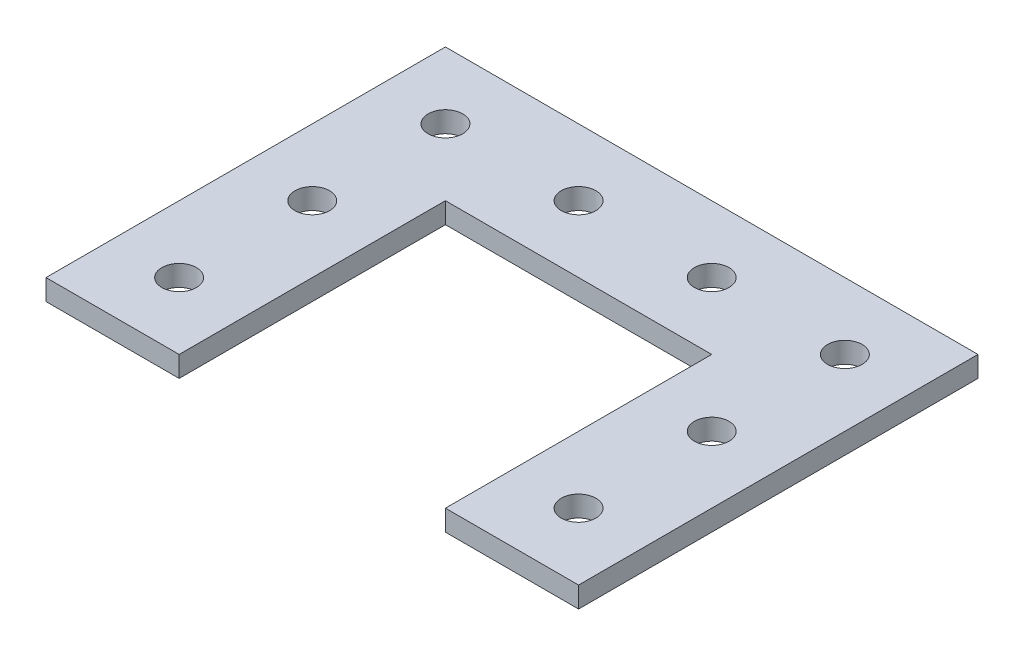
ISO-10303-21;
HEADER;
FILE_DESCRIPTION(('STEP AP214'),'2;1');
FILE_NAME('part.step','',(''),(''),'','','');
FILE_SCHEMA(('AUTOMOTIVE_DESIGN { 1 0 10303 214 1 1 1 1 }'));
ENDSEC;
DATA;
#1=APPLICATION_CONTEXT('core data for automotive mechanical design processes');
#2=APPLICATION_PROTOCOL_DEFINITION('international standard','automotive_design',2000,#1);
#3=PRODUCT_CONTEXT('',#1,'mechanical');
#4=PRODUCT('Part','Part','',(#3));
#5=PRODUCT_RELATED_PRODUCT_CATEGORY('part','',(#4));
#6=PRODUCT_DEFINITION_FORMATION('','',#4);
#7=PRODUCT_DEFINITION_CONTEXT('part definition',#1,'design');
#8=PRODUCT_DEFINITION('design','',#6,#7);
#9=PRODUCT_DEFINITION_SHAPE('','',#8);
#10=(LENGTH_UNIT() NAMED_UNIT(*) SI_UNIT(.MILLI.,.METRE.));
#11=(NAMED_UNIT(*) PLANE_ANGLE_UNIT() SI_UNIT($,.RADIAN.));
#12=(NAMED_UNIT(*) SI_UNIT($,.STERADIAN.) SOLID_ANGLE_UNIT());
#13=UNCERTAINTY_MEASURE_WITH_UNIT(LENGTH_MEASURE(1.E-05),#10,'distance_accuracy_value','');
#14=(GEOMETRIC_REPRESENTATION_CONTEXT(3) GLOBAL_UNCERTAINTY_ASSIGNED_CONTEXT((#13)) GLOBAL_UNIT_ASSIGNED_CONTEXT((#10,
#11,#12)) REPRESENTATION_CONTEXT('',''));
#15=CARTESIAN_POINT('',(0.,0.,0.));
#16=DIRECTION('',(0.,0.,1.));
#17=DIRECTION('',(1.,0.,0.));
#18=AXIS2_PLACEMENT_3D('',#15,#16,#17);
#19=CARTESIAN_POINT('',(0.,3.125,0.));
#20=DIRECTION('',(0.,-1.,0.));
#21=DIRECTION('',(0.,0.,-1.));
#22=AXIS2_PLACEMENT_3D('',#19,#20,#21);
#23=PLANE('',#22);
#24=CARTESIAN_POINT('',(70.,3.125,-30.));
#25=DIRECTION('',(0.,1.,0.));
#26=DIRECTION('',(0.,0.,1.));
#27=AXIS2_PLACEMENT_3D('',#24,#25,#26);
#28=CIRCLE('',#27,2.6);
#29=CARTESIAN_POINT('',(70.,3.125,-27.4));
#30=VERTEX_POINT('',#29);
#31=EDGE_CURVE('E211',#30,#30,#28,.T.);
#32=ORIENTED_EDGE('',*,*,#31,.F.);
#33=EDGE_LOOP('',(#32));
#34=FACE_BOUND('',#33,.T.);
#35=CARTESIAN_POINT('',(50.,3.125,-50.));
#36=DIRECTION('',(0.,1.,0.));
#37=DIRECTION('',(0.,0.,1.));
#38=AXIS2_PLACEMENT_3D('',#35,#36,#37);
#39=CIRCLE('',#38,2.6);
#40=CARTESIAN_POINT('',(50.,3.125,-47.4));
#41=VERTEX_POINT('',#40);
#42=EDGE_CURVE('E199',#41,#41,#39,.T.);
#43=ORIENTED_EDGE('',*,*,#42,.F.);
#44=EDGE_LOOP('',(#43));
#45=FACE_BOUND('',#44,.T.);
#46=CARTESIAN_POINT('',(10.,3.125,-9.99999999999999));
#47=DIRECTION('',(0.,1.,0.));
#48=DIRECTION('',(0.,0.,1.));
#49=AXIS2_PLACEMENT_3D('',#46,#47,#48);
#50=CIRCLE('',#49,2.6);
#51=CARTESIAN_POINT('',(10.,3.125,-7.4));
#52=VERTEX_POINT('',#51);
#53=EDGE_CURVE('E187',#52,#52,#50,.T.);
#54=ORIENTED_EDGE('',*,*,#53,.F.);
#55=EDGE_LOOP('',(#54));
#56=FACE_BOUND('',#55,.T.);
#57=CARTESIAN_POINT('',(10.,3.125,-50.));
#58=DIRECTION('',(0.,1.,0.));
#59=DIRECTION('',(0.,0.,1.));
#60=AXIS2_PLACEMENT_3D('',#57,#58,#59);
#61=CIRCLE('',#60,2.6);
#62=CARTESIAN_POINT('',(10.,3.125,-47.4));
#63=VERTEX_POINT('',#62);
#64=EDGE_CURVE('E133',#63,#63,#61,.T.);
#65=ORIENTED_EDGE('',*,*,#64,.F.);
#66=EDGE_LOOP('',(#65));
#67=FACE_BOUND('',#66,.T.);
#68=DIRECTION('',(1.,0.,0.));
#69=VECTOR('',#68,1.);
#70=CARTESIAN_POINT('',(20.,3.125,0.));
#71=LINE('',#70,#69);
#72=CARTESIAN_POINT('',(0.,3.125,0.));
#73=VERTEX_POINT('',#72);
#74=CARTESIAN_POINT('',(20.,3.125,0.));
#75=VERTEX_POINT('',#74);
#76=EDGE_CURVE('E144',#73,#75,#71,.T.);
#77=ORIENTED_EDGE('',*,*,#76,.T.);
#78=DIRECTION('',(0.,0.,-1.));
#79=VECTOR('',#78,1.);
#80=CARTESIAN_POINT('',(20.,3.125,-40.));
#81=LINE('',#80,#79);
#82=CARTESIAN_POINT('',(20.,3.125,-40.));
#83=VERTEX_POINT('',#82);
#84=EDGE_CURVE('E92',#75,#83,#81,.T.);
#85=ORIENTED_EDGE('',*,*,#84,.T.);
#86=DIRECTION('',(1.,0.,0.));
#87=VECTOR('',#86,1.);
#88=CARTESIAN_POINT('',(60.,3.125,-40.));
#89=LINE('',#88,#87);
#90=CARTESIAN_POINT('',(60.,3.125,-40.));
#91=VERTEX_POINT('',#90);
#92=EDGE_CURVE('E159',#83,#91,#89,.T.);
#93=ORIENTED_EDGE('',*,*,#92,.T.);
#94=DIRECTION('',(0.,0.,1.));
#95=VECTOR('',#94,1.);
#96=CARTESIAN_POINT('',(60.,3.125,0.));
#97=LINE('',#96,#95);
#98=CARTESIAN_POINT('',(60.,3.125,0.));
#99=VERTEX_POINT('',#98);
#100=EDGE_CURVE('E172',#91,#99,#97,.T.);
#101=ORIENTED_EDGE('',*,*,#100,.T.);
#102=DIRECTION('',(1.,0.,0.));
#103=VECTOR('',#102,1.);
#104=CARTESIAN_POINT('',(80.,3.125,0.));
#105=LINE('',#104,#103);
#106=CARTESIAN_POINT('',(80.,3.125,0.));
#107=VERTEX_POINT('',#106);
#108=EDGE_CURVE('E111',#99,#107,#105,.T.);
#109=ORIENTED_EDGE('',*,*,#108,.T.);
#110=DIRECTION('',(0.,0.,-1.));
#111=VECTOR('',#110,1.);
#112=CARTESIAN_POINT('',(80.,3.125,-60.));
#113=LINE('',#112,#111);
#114=CARTESIAN_POINT('',(80.,3.125,-60.));
#115=VERTEX_POINT('',#114);
#116=EDGE_CURVE('E105',#107,#115,#113,.T.);
#117=ORIENTED_EDGE('',*,*,#116,.T.);
#118=DIRECTION('',(-1.,0.,0.));
#119=VECTOR('',#118,1.);
#120=CARTESIAN_POINT('',(0.,3.125,-60.));
#121=LINE('',#120,#119);
#122=CARTESIAN_POINT('',(0.,3.125,-60.));
#123=VERTEX_POINT('',#122);
#124=EDGE_CURVE('E109',#115,#123,#121,.T.);
#125=ORIENTED_EDGE('',*,*,#124,.T.);
#126=DIRECTION('',(0.,0.,1.));
#127=VECTOR('',#126,1.);
#128=CARTESIAN_POINT('',(0.,3.125,0.));
#129=LINE('',#128,#127);
#130=EDGE_CURVE('E49',#123,#73,#129,.T.);
#131=ORIENTED_EDGE('',*,*,#130,.T.);
#132=EDGE_LOOP('',(#77,#85,#93,#101,#109,#117,#125,#131));
#133=FACE_BOUND('',#132,.T.);
#134=CARTESIAN_POINT('',(10.,3.125,-30.));
#135=DIRECTION('',(0.,1.,0.));
#136=DIRECTION('',(0.,0.,1.));
#137=AXIS2_PLACEMENT_3D('',#134,#135,#136);
#138=CIRCLE('',#137,2.6);
#139=CARTESIAN_POINT('',(10.,3.125,-27.4));
#140=VERTEX_POINT('',#139);
#141=EDGE_CURVE('E181',#140,#140,#138,.T.);
#142=ORIENTED_EDGE('',*,*,#141,.F.);
#143=EDGE_LOOP('',(#142));
#144=FACE_BOUND('',#143,.T.);
#145=CARTESIAN_POINT('',(30.,3.125,-50.));
#146=DIRECTION('',(0.,1.,0.));
#147=DIRECTION('',(0.,0.,1.));
#148=AXIS2_PLACEMENT_3D('',#145,#146,#147);
#149=CIRCLE('',#148,2.6);
#150=CARTESIAN_POINT('',(30.,3.125,-47.4));
#151=VERTEX_POINT('',#150);
#152=EDGE_CURVE('E193',#151,#151,#149,.T.);
#153=ORIENTED_EDGE('',*,*,#152,.F.);
#154=EDGE_LOOP('',(#153));
#155=FACE_BOUND('',#154,.T.);
#156=CARTESIAN_POINT('',(70.,3.125,-50.));
#157=DIRECTION('',(0.,1.,0.));
#158=DIRECTION('',(0.,0.,1.));
#159=AXIS2_PLACEMENT_3D('',#156,#157,#158);
#160=CIRCLE('',#159,2.6);
#161=CARTESIAN_POINT('',(70.,3.125,-47.4));
#162=VERTEX_POINT('',#161);
#163=EDGE_CURVE('E205',#162,#162,#160,.T.);
#164=ORIENTED_EDGE('',*,*,#163,.F.);
#165=EDGE_LOOP('',(#164));
#166=FACE_BOUND('',#165,.T.);
#167=CARTESIAN_POINT('',(70.,3.125,-9.99999999999999));
#168=DIRECTION('',(0.,1.,0.));
#169=DIRECTION('',(0.,0.,1.));
#170=AXIS2_PLACEMENT_3D('',#167,#168,#169);
#171=CIRCLE('',#170,2.6);
#172=CARTESIAN_POINT('',(70.,3.125,-7.39999999999999));
#173=VERTEX_POINT('',#172);
#174=EDGE_CURVE('E217',#173,#173,#171,.T.);
#175=ORIENTED_EDGE('',*,*,#174,.F.);
#176=EDGE_LOOP('',(#175));
#177=FACE_BOUND('',#176,.T.);
#178=ADVANCED_FACE('F32',(#34,#45,#56,#67,#133,#144,#155,#166,#177),#23,.F.);
#179=CARTESIAN_POINT('',(0.,0.,0.));
#180=DIRECTION('',(0.,-1.,0.));
#181=DIRECTION('',(0.,0.,-1.));
#182=AXIS2_PLACEMENT_3D('',#179,#180,#181);
#183=PLANE('',#182);
#184=CARTESIAN_POINT('',(70.,0.,-30.));
#185=DIRECTION('',(0.,1.,0.));
#186=DIRECTION('',(0.,0.,1.));
#187=AXIS2_PLACEMENT_3D('',#184,#185,#186);
#188=CIRCLE('',#187,2.6);
#189=CARTESIAN_POINT('',(70.,0.,-27.4));
#190=VERTEX_POINT('',#189);
#191=EDGE_CURVE('E214',#190,#190,#188,.T.);
#192=ORIENTED_EDGE('',*,*,#191,.T.);
#193=EDGE_LOOP('',(#192));
#194=FACE_BOUND('',#193,.T.);
#195=CARTESIAN_POINT('',(50.,0.,-50.));
#196=DIRECTION('',(0.,1.,0.));
#197=DIRECTION('',(0.,0.,1.));
#198=AXIS2_PLACEMENT_3D('',#195,#196,#197);
#199=CIRCLE('',#198,2.6);
#200=CARTESIAN_POINT('',(50.,0.,-47.4));
#201=VERTEX_POINT('',#200);
#202=EDGE_CURVE('E202',#201,#201,#199,.T.);
#203=ORIENTED_EDGE('',*,*,#202,.T.);
#204=EDGE_LOOP('',(#203));
#205=FACE_BOUND('',#204,.T.);
#206=CARTESIAN_POINT('',(10.,0.,-9.99999999999999));
#207=DIRECTION('',(0.,1.,0.));
#208=DIRECTION('',(0.,0.,1.));
#209=AXIS2_PLACEMENT_3D('',#206,#207,#208);
#210=CIRCLE('',#209,2.6);
#211=CARTESIAN_POINT('',(10.,0.,-7.4));
#212=VERTEX_POINT('',#211);
#213=EDGE_CURVE('E190',#212,#212,#210,.T.);
#214=ORIENTED_EDGE('',*,*,#213,.T.);
#215=EDGE_LOOP('',(#214));
#216=FACE_BOUND('',#215,.T.);
#217=CARTESIAN_POINT('',(10.,0.,-50.));
#218=DIRECTION('',(0.,1.,0.));
#219=DIRECTION('',(0.,0.,1.));
#220=AXIS2_PLACEMENT_3D('',#217,#218,#219);
#221=CIRCLE('',#220,2.6);
#222=CARTESIAN_POINT('',(10.,0.,-47.4));
#223=VERTEX_POINT('',#222);
#224=EDGE_CURVE('E178',#223,#223,#221,.T.);
#225=ORIENTED_EDGE('',*,*,#224,.T.);
#226=EDGE_LOOP('',(#225));
#227=FACE_BOUND('',#226,.T.);
#228=DIRECTION('',(1.,0.,0.));
#229=VECTOR('',#228,1.);
#230=CARTESIAN_POINT('',(20.,0.,0.));
#231=LINE('',#230,#229);
#232=CARTESIAN_POINT('',(0.,0.,0.));
#233=VERTEX_POINT('',#232);
#234=CARTESIAN_POINT('',(20.,0.,0.));
#235=VERTEX_POINT('',#234);
#236=EDGE_CURVE('E129',#233,#235,#231,.T.);
#237=ORIENTED_EDGE('',*,*,#236,.F.);
#238=DIRECTION('',(0.,0.,1.));
#239=VECTOR('',#238,1.);
#240=CARTESIAN_POINT('',(0.,0.,0.));
#241=LINE('',#240,#239);
#242=CARTESIAN_POINT('',(0.,0.,-60.));
#243=VERTEX_POINT('',#242);
#244=EDGE_CURVE('E84',#243,#233,#241,.T.);
#245=ORIENTED_EDGE('',*,*,#244,.F.);
#246=DIRECTION('',(-1.,0.,0.));
#247=VECTOR('',#246,1.);
#248=CARTESIAN_POINT('',(0.,0.,-60.));
#249=LINE('',#248,#247);
#250=CARTESIAN_POINT('',(80.,0.,-60.));
#251=VERTEX_POINT('',#250);
#252=EDGE_CURVE('E78',#251,#243,#249,.T.);
#253=ORIENTED_EDGE('',*,*,#252,.F.);
#254=DIRECTION('',(0.,0.,-1.));
#255=VECTOR('',#254,1.);
#256=CARTESIAN_POINT('',(80.,0.,-60.));
#257=LINE('',#256,#255);
#258=CARTESIAN_POINT('',(80.,0.,0.));
#259=VERTEX_POINT('',#258);
#260=EDGE_CURVE('E119',#259,#251,#257,.T.);
#261=ORIENTED_EDGE('',*,*,#260,.F.);
#262=DIRECTION('',(1.,0.,0.));
#263=VECTOR('',#262,1.);
#264=CARTESIAN_POINT('',(80.,0.,0.));
#265=LINE('',#264,#263);
#266=CARTESIAN_POINT('',(60.,0.,0.));
#267=VERTEX_POINT('',#266);
#268=EDGE_CURVE('E139',#267,#259,#265,.T.);
#269=ORIENTED_EDGE('',*,*,#268,.F.);
#270=DIRECTION('',(0.,0.,1.));
#271=VECTOR('',#270,1.);
#272=CARTESIAN_POINT('',(60.,0.,0.));
#273=LINE('',#272,#271);
#274=CARTESIAN_POINT('',(60.,0.,-40.));
#275=VERTEX_POINT('',#274);
#276=EDGE_CURVE('E137',#275,#267,#273,.T.);
#277=ORIENTED_EDGE('',*,*,#276,.F.);
#278=DIRECTION('',(1.,0.,0.));
#279=VECTOR('',#278,1.);
#280=CARTESIAN_POINT('',(60.,0.,-40.));
#281=LINE('',#280,#279);
#282=CARTESIAN_POINT('',(20.,0.,-40.));
#283=VERTEX_POINT('',#282);
#284=EDGE_CURVE('E135',#283,#275,#281,.T.);
#285=ORIENTED_EDGE('',*,*,#284,.F.);
#286=DIRECTION('',(0.,0.,-1.));
#287=VECTOR('',#286,1.);
#288=CARTESIAN_POINT('',(20.,0.,-40.));
#289=LINE('',#288,#287);
#290=EDGE_CURVE('E132',#235,#283,#289,.T.);
#291=ORIENTED_EDGE('',*,*,#290,.F.);
#292=EDGE_LOOP('',(#237,#245,#253,#261,#269,#277,#285,#291));
#293=FACE_BOUND('',#292,.T.);
#294=CARTESIAN_POINT('',(10.,0.,-30.));
#295=DIRECTION('',(0.,1.,0.));
#296=DIRECTION('',(0.,0.,1.));
#297=AXIS2_PLACEMENT_3D('',#294,#295,#296);
#298=CIRCLE('',#297,2.6);
#299=CARTESIAN_POINT('',(10.,0.,-27.4));
#300=VERTEX_POINT('',#299);
#301=EDGE_CURVE('E184',#300,#300,#298,.T.);
#302=ORIENTED_EDGE('',*,*,#301,.T.);
#303=EDGE_LOOP('',(#302));
#304=FACE_BOUND('',#303,.T.);
#305=CARTESIAN_POINT('',(30.,0.,-50.));
#306=DIRECTION('',(0.,1.,0.));
#307=DIRECTION('',(0.,0.,1.));
#308=AXIS2_PLACEMENT_3D('',#305,#306,#307);
#309=CIRCLE('',#308,2.6);
#310=CARTESIAN_POINT('',(30.,0.,-47.4));
#311=VERTEX_POINT('',#310);
#312=EDGE_CURVE('E196',#311,#311,#309,.T.);
#313=ORIENTED_EDGE('',*,*,#312,.T.);
#314=EDGE_LOOP('',(#313));
#315=FACE_BOUND('',#314,.T.);
#316=CARTESIAN_POINT('',(70.,0.,-50.));
#317=DIRECTION('',(0.,1.,0.));
#318=DIRECTION('',(0.,0.,1.));
#319=AXIS2_PLACEMENT_3D('',#316,#317,#318);
#320=CIRCLE('',#319,2.6);
#321=CARTESIAN_POINT('',(70.,0.,-47.4));
#322=VERTEX_POINT('',#321);
#323=EDGE_CURVE('E208',#322,#322,#320,.T.);
#324=ORIENTED_EDGE('',*,*,#323,.T.);
#325=EDGE_LOOP('',(#324));
#326=FACE_BOUND('',#325,.T.);
#327=CARTESIAN_POINT('',(70.,0.,-9.99999999999999));
#328=DIRECTION('',(0.,1.,0.));
#329=DIRECTION('',(0.,0.,1.));
#330=AXIS2_PLACEMENT_3D('',#327,#328,#329);
#331=CIRCLE('',#330,2.6);
#332=CARTESIAN_POINT('',(70.,0.,-7.39999999999999));
#333=VERTEX_POINT('',#332);
#334=EDGE_CURVE('E220',#333,#333,#331,.T.);
#335=ORIENTED_EDGE('',*,*,#334,.T.);
#336=EDGE_LOOP('',(#335));
#337=FACE_BOUND('',#336,.T.);
#338=ADVANCED_FACE('F163',(#194,#205,#216,#227,#293,#304,#315,#326,#337),#183,.T.);
#339=CARTESIAN_POINT('',(20.,3.125,0.));
#340=DIRECTION('',(0.,0.,-1.));
#341=DIRECTION('',(-1.,0.,0.));
#342=AXIS2_PLACEMENT_3D('',#339,#340,#341);
#343=PLANE('',#342);
#344=ORIENTED_EDGE('',*,*,#236,.T.);
#345=DIRECTION('',(0.,-1.,0.));
#346=VECTOR('',#345,1.);
#347=CARTESIAN_POINT('',(20.,3.125,0.));
#348=LINE('',#347,#346);
#349=EDGE_CURVE('E11',#75,#235,#348,.T.);
#350=ORIENTED_EDGE('',*,*,#349,.F.);
#351=ORIENTED_EDGE('',*,*,#76,.F.);
#352=DIRECTION('',(0.,-1.,0.));
#353=VECTOR('',#352,1.);
#354=CARTESIAN_POINT('',(0.,3.125,0.));
#355=LINE('',#354,#353);
#356=EDGE_CURVE('E125',#73,#233,#355,.T.);
#357=ORIENTED_EDGE('',*,*,#356,.T.);
#358=EDGE_LOOP('',(#344,#350,#351,#357));
#359=FACE_BOUND('',#358,.T.);
#360=ADVANCED_FACE('F34',(#359),#343,.F.);
#361=CARTESIAN_POINT('',(20.,3.125,-40.));
#362=DIRECTION('',(-1.,0.,0.));
#363=DIRECTION('',(0.,0.,1.));
#364=AXIS2_PLACEMENT_3D('',#361,#362,#363);
#365=PLANE('',#364);
#366=ORIENTED_EDGE('',*,*,#290,.T.);
#367=DIRECTION('',(0.,-1.,0.));
#368=VECTOR('',#367,1.);
#369=CARTESIAN_POINT('',(20.,3.125,-40.));
#370=LINE('',#369,#368);
#371=EDGE_CURVE('E41',#83,#283,#370,.T.);
#372=ORIENTED_EDGE('',*,*,#371,.F.);
#373=ORIENTED_EDGE('',*,*,#84,.F.);
#374=ORIENTED_EDGE('',*,*,#349,.T.);
#375=EDGE_LOOP('',(#366,#372,#373,#374));
#376=FACE_BOUND('',#375,.T.);
#377=ADVANCED_FACE('F255',(#376),#365,.F.);
#378=CARTESIAN_POINT('',(60.,3.125,-40.));
#379=DIRECTION('',(0.,0.,-1.));
#380=DIRECTION('',(-1.,0.,0.));
#381=AXIS2_PLACEMENT_3D('',#378,#379,#380);
#382=PLANE('',#381);
#383=ORIENTED_EDGE('',*,*,#284,.T.);
#384=DIRECTION('',(0.,-1.,0.));
#385=VECTOR('',#384,1.);
#386=CARTESIAN_POINT('',(60.,3.125,-40.));
#387=LINE('',#386,#385);
#388=EDGE_CURVE('E151',#91,#275,#387,.T.);
#389=ORIENTED_EDGE('',*,*,#388,.F.);
#390=ORIENTED_EDGE('',*,*,#92,.F.);
#391=ORIENTED_EDGE('',*,*,#371,.T.);
#392=EDGE_LOOP('',(#383,#389,#390,#391));
#393=FACE_BOUND('',#392,.T.);
#394=ADVANCED_FACE('F157',(#393),#382,.F.);
#395=CARTESIAN_POINT('',(60.,3.125,0.));
#396=DIRECTION('',(1.,0.,0.));
#397=DIRECTION('',(0.,0.,-1.));
#398=AXIS2_PLACEMENT_3D('',#395,#396,#397);
#399=PLANE('',#398);
#400=ORIENTED_EDGE('',*,*,#276,.T.);
#401=DIRECTION('',(0.,-1.,0.));
#402=VECTOR('',#401,1.);
#403=CARTESIAN_POINT('',(60.,3.125,0.));
#404=LINE('',#403,#402);
#405=EDGE_CURVE('E148',#99,#267,#404,.T.);
#406=ORIENTED_EDGE('',*,*,#405,.F.);
#407=ORIENTED_EDGE('',*,*,#100,.F.);
#408=ORIENTED_EDGE('',*,*,#388,.T.);
#409=EDGE_LOOP('',(#400,#406,#407,#408));
#410=FACE_BOUND('',#409,.T.);
#411=ADVANCED_FACE('F168',(#410),#399,.F.);
#412=CARTESIAN_POINT('',(80.,3.125,0.));
#413=DIRECTION('',(0.,0.,-1.));
#414=DIRECTION('',(-1.,0.,0.));
#415=AXIS2_PLACEMENT_3D('',#412,#413,#414);
#416=PLANE('',#415);
#417=ORIENTED_EDGE('',*,*,#268,.T.);
#418=DIRECTION('',(0.,-1.,0.));
#419=VECTOR('',#418,1.);
#420=CARTESIAN_POINT('',(80.,3.125,0.));
#421=LINE('',#420,#419);
#422=EDGE_CURVE('E120',#107,#259,#421,.T.);
#423=ORIENTED_EDGE('',*,*,#422,.F.);
#424=ORIENTED_EDGE('',*,*,#108,.F.);
#425=ORIENTED_EDGE('',*,*,#405,.T.);
#426=EDGE_LOOP('',(#417,#423,#424,#425));
#427=FACE_BOUND('',#426,.T.);
#428=ADVANCED_FACE('F171',(#427),#416,.F.);
#429=CARTESIAN_POINT('',(80.,3.125,-60.));
#430=DIRECTION('',(-1.,0.,0.));
#431=DIRECTION('',(0.,0.,1.));
#432=AXIS2_PLACEMENT_3D('',#429,#430,#431);
#433=PLANE('',#432);
#434=ORIENTED_EDGE('',*,*,#260,.T.);
#435=DIRECTION('',(0.,-1.,0.));
#436=VECTOR('',#435,1.);
#437=CARTESIAN_POINT('',(80.,3.125,-60.));
#438=LINE('',#437,#436);
#439=EDGE_CURVE('E116',#115,#251,#438,.T.);
#440=ORIENTED_EDGE('',*,*,#439,.F.);
#441=ORIENTED_EDGE('',*,*,#116,.F.);
#442=ORIENTED_EDGE('',*,*,#422,.T.);
#443=EDGE_LOOP('',(#434,#440,#441,#442));
#444=FACE_BOUND('',#443,.T.);
#445=ADVANCED_FACE('F117',(#444),#433,.F.);
#446=CARTESIAN_POINT('',(0.,3.125,-60.));
#447=DIRECTION('',(0.,0.,1.));
#448=DIRECTION('',(1.,0.,0.));
#449=AXIS2_PLACEMENT_3D('',#446,#447,#448);
#450=PLANE('',#449);
#451=ORIENTED_EDGE('',*,*,#252,.T.);
#452=DIRECTION('',(0.,-1.,0.));
#453=VECTOR('',#452,1.);
#454=CARTESIAN_POINT('',(0.,3.125,-60.));
#455=LINE('',#454,#453);
#456=EDGE_CURVE('E121',#123,#243,#455,.T.);
#457=ORIENTED_EDGE('',*,*,#456,.F.);
#458=ORIENTED_EDGE('',*,*,#124,.F.);
#459=ORIENTED_EDGE('',*,*,#439,.T.);
#460=EDGE_LOOP('',(#451,#457,#458,#459));
#461=FACE_BOUND('',#460,.T.);
#462=ADVANCED_FACE('F123',(#461),#450,.F.);
#463=CARTESIAN_POINT('',(0.,3.125,0.));
#464=DIRECTION('',(1.,0.,0.));
#465=DIRECTION('',(0.,0.,-1.));
#466=AXIS2_PLACEMENT_3D('',#463,#464,#465);
#467=PLANE('',#466);
#468=ORIENTED_EDGE('',*,*,#244,.T.);
#469=ORIENTED_EDGE('',*,*,#356,.F.);
#470=ORIENTED_EDGE('',*,*,#130,.F.);
#471=ORIENTED_EDGE('',*,*,#456,.T.);
#472=EDGE_LOOP('',(#468,#469,#470,#471));
#473=FACE_BOUND('',#472,.T.);
#474=ADVANCED_FACE('F243',(#473),#467,.F.);
#475=CARTESIAN_POINT('',(10.,3.125,-50.));
#476=DIRECTION('',(0.,-1.,0.));
#477=DIRECTION('',(0.,0.,-1.));
#478=AXIS2_PLACEMENT_3D('',#475,#476,#477);
#479=CYLINDRICAL_SURFACE('',#478,2.6);
#480=ORIENTED_EDGE('',*,*,#64,.T.);
#481=EDGE_LOOP('',(#480));
#482=FACE_BOUND('',#481,.T.);
#483=ORIENTED_EDGE('',*,*,#224,.F.);
#484=EDGE_LOOP('',(#483));
#485=FACE_BOUND('',#484,.T.);
#486=ADVANCED_FACE('F240',(#482,#485),#479,.F.);
#487=CARTESIAN_POINT('',(10.,3.125,-30.));
#488=DIRECTION('',(0.,-1.,0.));
#489=DIRECTION('',(0.,0.,-1.));
#490=AXIS2_PLACEMENT_3D('',#487,#488,#489);
#491=CYLINDRICAL_SURFACE('',#490,2.6);
#492=ORIENTED_EDGE('',*,*,#141,.T.);
#493=EDGE_LOOP('',(#492));
#494=FACE_BOUND('',#493,.T.);
#495=ORIENTED_EDGE('',*,*,#301,.F.);
#496=EDGE_LOOP('',(#495));
#497=FACE_BOUND('',#496,.T.);
#498=ADVANCED_FACE('F319',(#494,#497),#491,.F.);
#499=CARTESIAN_POINT('',(10.,3.125,-9.99999999999999));
#500=DIRECTION('',(0.,-1.,0.));
#501=DIRECTION('',(0.,0.,-1.));
#502=AXIS2_PLACEMENT_3D('',#499,#500,#501);
#503=CYLINDRICAL_SURFACE('',#502,2.6);
#504=ORIENTED_EDGE('',*,*,#53,.T.);
#505=EDGE_LOOP('',(#504));
#506=FACE_BOUND('',#505,.T.);
#507=ORIENTED_EDGE('',*,*,#213,.F.);
#508=EDGE_LOOP('',(#507));
#509=FACE_BOUND('',#508,.T.);
#510=ADVANCED_FACE('F327',(#506,#509),#503,.F.);
#511=CARTESIAN_POINT('',(30.,3.125,-50.));
#512=DIRECTION('',(0.,-1.,0.));
#513=DIRECTION('',(0.,0.,-1.));
#514=AXIS2_PLACEMENT_3D('',#511,#512,#513);
#515=CYLINDRICAL_SURFACE('',#514,2.6);
#516=ORIENTED_EDGE('',*,*,#152,.T.);
#517=EDGE_LOOP('',(#516));
#518=FACE_BOUND('',#517,.T.);
#519=ORIENTED_EDGE('',*,*,#312,.F.);
#520=EDGE_LOOP('',(#519));
#521=FACE_BOUND('',#520,.T.);
#522=ADVANCED_FACE('F335',(#518,#521),#515,.F.);
#523=CARTESIAN_POINT('',(50.,3.125,-50.));
#524=DIRECTION('',(0.,-1.,0.));
#525=DIRECTION('',(0.,0.,-1.));
#526=AXIS2_PLACEMENT_3D('',#523,#524,#525);
#527=CYLINDRICAL_SURFACE('',#526,2.6);
#528=ORIENTED_EDGE('',*,*,#42,.T.);
#529=EDGE_LOOP('',(#528));
#530=FACE_BOUND('',#529,.T.);
#531=ORIENTED_EDGE('',*,*,#202,.F.);
#532=EDGE_LOOP('',(#531));
#533=FACE_BOUND('',#532,.T.);
#534=ADVANCED_FACE('F344',(#530,#533),#527,.F.);
#535=CARTESIAN_POINT('',(70.,3.125,-50.));
#536=DIRECTION('',(0.,-1.,0.));
#537=DIRECTION('',(0.,0.,-1.));
#538=AXIS2_PLACEMENT_3D('',#535,#536,#537);
#539=CYLINDRICAL_SURFACE('',#538,2.6);
#540=ORIENTED_EDGE('',*,*,#163,.T.);
#541=EDGE_LOOP('',(#540));
#542=FACE_BOUND('',#541,.T.);
#543=ORIENTED_EDGE('',*,*,#323,.F.);
#544=EDGE_LOOP('',(#543));
#545=FACE_BOUND('',#544,.T.);
#546=ADVANCED_FACE('F353',(#542,#545),#539,.F.);
#547=CARTESIAN_POINT('',(70.,3.125,-30.));
#548=DIRECTION('',(0.,-1.,0.));
#549=DIRECTION('',(0.,0.,-1.));
#550=AXIS2_PLACEMENT_3D('',#547,#548,#549);
#551=CYLINDRICAL_SURFACE('',#550,2.6);
#552=ORIENTED_EDGE('',*,*,#31,.T.);
#553=EDGE_LOOP('',(#552));
#554=FACE_BOUND('',#553,.T.);
#555=ORIENTED_EDGE('',*,*,#191,.F.);
#556=EDGE_LOOP('',(#555));
#557=FACE_BOUND('',#556,.T.);
#558=ADVANCED_FACE('F362',(#554,#557),#551,.F.);
#559=CARTESIAN_POINT('',(70.,3.125,-9.99999999999999));
#560=DIRECTION('',(0.,-1.,0.));
#561=DIRECTION('',(0.,0.,-1.));
#562=AXIS2_PLACEMENT_3D('',#559,#560,#561);
#563=CYLINDRICAL_SURFACE('',#562,2.6);
#564=ORIENTED_EDGE('',*,*,#174,.T.);
#565=EDGE_LOOP('',(#564));
#566=FACE_BOUND('',#565,.T.);
#567=ORIENTED_EDGE('',*,*,#334,.F.);
#568=EDGE_LOOP('',(#567));
#569=FACE_BOUND('',#568,.T.);
#570=ADVANCED_FACE('F226',(#566,#569),#563,.F.);
#571=CLOSED_SHELL('',(#178,#338,#360,#377,#394,#411,#428,#445,#462,#474,#486,#498,#510,#522,
#534,#546,#558,#570));
#572=MANIFOLD_SOLID_BREP('B2',#571);
#573=ADVANCED_BREP_SHAPE_REPRESENTATION('',(#18,#572),#14);
#574=SHAPE_DEFINITION_REPRESENTATION(#9,#573);
ENDSEC;
END-ISO-10303-21;
